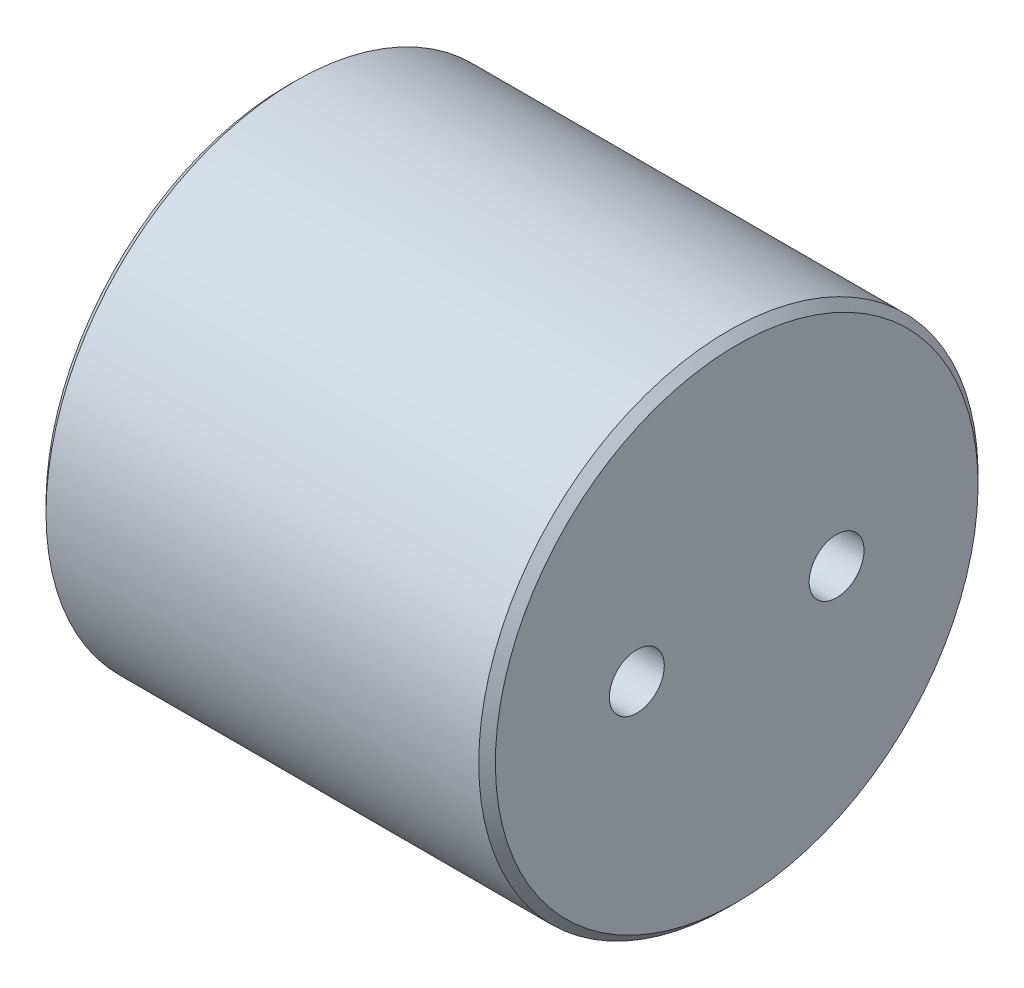
ISO-10303-21;
HEADER;
FILE_DESCRIPTION(('STEP AP214'),'2;1');
FILE_NAME('part.step','',(''),(''),'','','');
FILE_SCHEMA(('AUTOMOTIVE_DESIGN { 1 0 10303 214 1 1 1 1 }'));
ENDSEC;
DATA;
#1=APPLICATION_CONTEXT('core data for automotive mechanical design processes');
#2=APPLICATION_PROTOCOL_DEFINITION('international standard','automotive_design',2000,#1);
#3=PRODUCT_CONTEXT('',#1,'mechanical');
#4=PRODUCT('Part','Part','',(#3));
#5=PRODUCT_RELATED_PRODUCT_CATEGORY('part','',(#4));
#6=PRODUCT_DEFINITION_FORMATION('','',#4);
#7=PRODUCT_DEFINITION_CONTEXT('part definition',#1,'design');
#8=PRODUCT_DEFINITION('design','',#6,#7);
#9=PRODUCT_DEFINITION_SHAPE('','',#8);
#10=(LENGTH_UNIT() NAMED_UNIT(*) SI_UNIT(.MILLI.,.METRE.));
#11=(NAMED_UNIT(*) PLANE_ANGLE_UNIT() SI_UNIT($,.RADIAN.));
#12=(NAMED_UNIT(*) SI_UNIT($,.STERADIAN.) SOLID_ANGLE_UNIT());
#13=UNCERTAINTY_MEASURE_WITH_UNIT(LENGTH_MEASURE(1.E-05),#10,'distance_accuracy_value','');
#14=(GEOMETRIC_REPRESENTATION_CONTEXT(3) GLOBAL_UNCERTAINTY_ASSIGNED_CONTEXT((#13)) GLOBAL_UNIT_ASSIGNED_CONTEXT((#10,
#11,#12)) REPRESENTATION_CONTEXT('',''));
#15=CARTESIAN_POINT('',(0.,0.,0.));
#16=DIRECTION('',(0.,0.,1.));
#17=DIRECTION('',(1.,0.,0.));
#18=AXIS2_PLACEMENT_3D('',#15,#16,#17);
#19=CARTESIAN_POINT('',(-1.99999999995271,0.,6.));
#20=DIRECTION('',(-1.,0.,0.));
#21=DIRECTION('',(0.,0.,1.));
#22=AXIS2_PLACEMENT_3D('',#19,#20,#21);
#23=CONICAL_SURFACE('',#22,1.64999999989868,1.02974425856973);
#24=CARTESIAN_POINT('',(-2.,0.,6.));
#25=DIRECTION('',(-1.,0.,0.));
#26=DIRECTION('',(0.,0.,1.));
#27=AXIS2_PLACEMENT_3D('',#24,#25,#26);
#28=CIRCLE('',#27,1.65);
#29=CARTESIAN_POINT('',(-2.,0.,7.65));
#30=VERTEX_POINT('',#29);
#31=EDGE_CURVE('E108',#30,#30,#28,.T.);
#32=ORIENTED_EDGE('',*,*,#31,.T.);
#33=EDGE_LOOP('',(#32));
#34=FACE_BOUND('',#33,.T.);
#35=CARTESIAN_POINT('',(-1.00857997858839,0.,5.99999999988654));
#36=VERTEX_POINT('',#35);
#37=VERTEX_LOOP('',#36);
#38=FACE_BOUND('',#37,.T.);
#39=ADVANCED_FACE('F16',(#34,#38),#23,.F.);
#40=CARTESIAN_POINT('',(-1.99999999995271,0.,-6.));
#41=DIRECTION('',(-1.,0.,0.));
#42=DIRECTION('',(0.,0.,1.));
#43=AXIS2_PLACEMENT_3D('',#40,#41,#42);
#44=CONICAL_SURFACE('',#43,1.64999999984138,1.02974425856948);
#45=CARTESIAN_POINT('',(-2.,0.,-6.));
#46=DIRECTION('',(-1.,0.,0.));
#47=DIRECTION('',(0.,0.,1.));
#48=AXIS2_PLACEMENT_3D('',#45,#46,#47);
#49=CIRCLE('',#48,1.65);
#50=CARTESIAN_POINT('',(-2.,0.,-4.35));
#51=VERTEX_POINT('',#50);
#52=EDGE_CURVE('E103',#51,#51,#49,.T.);
#53=ORIENTED_EDGE('',*,*,#52,.T.);
#54=EDGE_LOOP('',(#53));
#55=FACE_BOUND('',#54,.T.);
#56=CARTESIAN_POINT('',(-1.00857997858839,0.,-6.00000000019918));
#57=VERTEX_POINT('',#56);
#58=VERTEX_LOOP('',#57);
#59=FACE_BOUND('',#58,.T.);
#60=ADVANCED_FACE('F39',(#55,#59),#44,.F.);
#61=CARTESIAN_POINT('',(1.99999999995271,0.,6.));
#62=DIRECTION('',(1.,0.,0.));
#63=DIRECTION('',(0.,0.,-1.));
#64=AXIS2_PLACEMENT_3D('',#61,#62,#63);
#65=CONICAL_SURFACE('',#64,1.64999999984138,1.02974425856948);
#66=CARTESIAN_POINT('',(2.,0.,6.));
#67=DIRECTION('',(1.,0.,0.));
#68=DIRECTION('',(0.,0.,-1.));
#69=AXIS2_PLACEMENT_3D('',#66,#67,#68);
#70=CIRCLE('',#69,1.65);
#71=CARTESIAN_POINT('',(2.,0.,4.35));
#72=VERTEX_POINT('',#71);
#73=EDGE_CURVE('E100',#72,#72,#70,.T.);
#74=ORIENTED_EDGE('',*,*,#73,.T.);
#75=EDGE_LOOP('',(#74));
#76=FACE_BOUND('',#75,.T.);
#77=CARTESIAN_POINT('',(1.00857997858839,0.,6.00000000019918));
#78=VERTEX_POINT('',#77);
#79=VERTEX_LOOP('',#78);
#80=FACE_BOUND('',#79,.T.);
#81=ADVANCED_FACE('F45',(#76,#80),#65,.F.);
#82=CARTESIAN_POINT('',(1.99999999995271,0.,-6.));
#83=DIRECTION('',(1.,0.,0.));
#84=DIRECTION('',(0.,0.,-1.));
#85=AXIS2_PLACEMENT_3D('',#82,#83,#84);
#86=CONICAL_SURFACE('',#85,1.64999999989868,1.02974425856973);
#87=CARTESIAN_POINT('',(2.,0.,-6.));
#88=DIRECTION('',(1.,0.,0.));
#89=DIRECTION('',(0.,0.,-1.));
#90=AXIS2_PLACEMENT_3D('',#87,#88,#89);
#91=CIRCLE('',#90,1.65);
#92=CARTESIAN_POINT('',(2.,0.,-7.65));
#93=VERTEX_POINT('',#92);
#94=EDGE_CURVE('E102',#93,#93,#91,.T.);
#95=ORIENTED_EDGE('',*,*,#94,.T.);
#96=EDGE_LOOP('',(#95));
#97=FACE_BOUND('',#96,.T.);
#98=CARTESIAN_POINT('',(1.00857997858839,0.,-5.99999999988654));
#99=VERTEX_POINT('',#98);
#100=VERTEX_LOOP('',#99);
#101=FACE_BOUND('',#100,.T.);
#102=ADVANCED_FACE('F88',(#97,#101),#86,.F.);
#103=CARTESIAN_POINT('',(-13.5,0.,6.));
#104=DIRECTION('',(-1.,0.,0.));
#105=DIRECTION('',(0.,0.,1.));
#106=AXIS2_PLACEMENT_3D('',#103,#104,#105);
#107=CYLINDRICAL_SURFACE('',#106,1.65);
#108=CARTESIAN_POINT('',(-13.5,0.,6.));
#109=DIRECTION('',(-1.,0.,0.));
#110=DIRECTION('',(0.,0.,1.));
#111=AXIS2_PLACEMENT_3D('',#108,#109,#110);
#112=CIRCLE('',#111,1.65);
#113=CARTESIAN_POINT('',(-13.5,0.,7.65));
#114=VERTEX_POINT('',#113);
#115=EDGE_CURVE('E19',#114,#114,#112,.F.);
#116=ORIENTED_EDGE('',*,*,#115,.F.);
#117=EDGE_LOOP('',(#116));
#118=FACE_BOUND('',#117,.T.);
#119=ORIENTED_EDGE('',*,*,#31,.F.);
#120=EDGE_LOOP('',(#119));
#121=FACE_BOUND('',#120,.T.);
#122=ADVANCED_FACE('F84',(#118,#121),#107,.F.);
#123=CARTESIAN_POINT('',(-13.5,0.,-6.));
#124=DIRECTION('',(-1.,0.,0.));
#125=DIRECTION('',(0.,0.,1.));
#126=AXIS2_PLACEMENT_3D('',#123,#124,#125);
#127=CYLINDRICAL_SURFACE('',#126,1.65);
#128=CARTESIAN_POINT('',(-13.5,0.,-6.));
#129=DIRECTION('',(-1.,0.,0.));
#130=DIRECTION('',(0.,0.,1.));
#131=AXIS2_PLACEMENT_3D('',#128,#129,#130);
#132=CIRCLE('',#131,1.65);
#133=CARTESIAN_POINT('',(-13.5,0.,-4.35));
#134=VERTEX_POINT('',#133);
#135=EDGE_CURVE('E123',#134,#134,#132,.F.);
#136=ORIENTED_EDGE('',*,*,#135,.F.);
#137=EDGE_LOOP('',(#136));
#138=FACE_BOUND('',#137,.T.);
#139=ORIENTED_EDGE('',*,*,#52,.F.);
#140=EDGE_LOOP('',(#139));
#141=FACE_BOUND('',#140,.T.);
#142=ADVANCED_FACE('F80',(#138,#141),#127,.F.);
#143=CARTESIAN_POINT('',(13.5,0.,6.));
#144=DIRECTION('',(1.,0.,0.));
#145=DIRECTION('',(0.,0.,-1.));
#146=AXIS2_PLACEMENT_3D('',#143,#144,#145);
#147=CYLINDRICAL_SURFACE('',#146,1.65);
#148=CARTESIAN_POINT('',(13.5,0.,6.));
#149=DIRECTION('',(1.,0.,0.));
#150=DIRECTION('',(0.,0.,-1.));
#151=AXIS2_PLACEMENT_3D('',#148,#149,#150);
#152=CIRCLE('',#151,1.65);
#153=CARTESIAN_POINT('',(13.5,0.,4.35));
#154=VERTEX_POINT('',#153);
#155=EDGE_CURVE('E121',#154,#154,#152,.F.);
#156=ORIENTED_EDGE('',*,*,#155,.F.);
#157=EDGE_LOOP('',(#156));
#158=FACE_BOUND('',#157,.T.);
#159=ORIENTED_EDGE('',*,*,#73,.F.);
#160=EDGE_LOOP('',(#159));
#161=FACE_BOUND('',#160,.T.);
#162=ADVANCED_FACE('F76',(#158,#161),#147,.F.);
#163=CARTESIAN_POINT('',(13.5,0.,-6.));
#164=DIRECTION('',(1.,0.,0.));
#165=DIRECTION('',(0.,0.,-1.));
#166=AXIS2_PLACEMENT_3D('',#163,#164,#165);
#167=CYLINDRICAL_SURFACE('',#166,1.65);
#168=CARTESIAN_POINT('',(13.5,0.,-6.));
#169=DIRECTION('',(1.,0.,0.));
#170=DIRECTION('',(0.,0.,-1.));
#171=AXIS2_PLACEMENT_3D('',#168,#169,#170);
#172=CIRCLE('',#171,1.65);
#173=CARTESIAN_POINT('',(13.5,0.,-7.65));
#174=VERTEX_POINT('',#173);
#175=EDGE_CURVE('E118',#174,#174,#172,.F.);
#176=ORIENTED_EDGE('',*,*,#175,.F.);
#177=EDGE_LOOP('',(#176));
#178=FACE_BOUND('',#177,.T.);
#179=ORIENTED_EDGE('',*,*,#94,.F.);
#180=EDGE_LOOP('',(#179));
#181=FACE_BOUND('',#180,.T.);
#182=ADVANCED_FACE('F72',(#178,#181),#167,.F.);
#183=CARTESIAN_POINT('',(-13.5,-15.,0.));
#184=DIRECTION('',(-1.,0.,0.));
#185=DIRECTION('',(0.,0.,1.));
#186=AXIS2_PLACEMENT_3D('',#183,#184,#185);
#187=PLANE('',#186);
#188=ORIENTED_EDGE('',*,*,#135,.T.);
#189=EDGE_LOOP('',(#188));
#190=FACE_BOUND('',#189,.T.);
#191=ORIENTED_EDGE('',*,*,#115,.T.);
#192=EDGE_LOOP('',(#191));
#193=FACE_BOUND('',#192,.T.);
#194=CARTESIAN_POINT('',(-13.5,0.,0.));
#195=DIRECTION('',(1.,0.,0.));
#196=DIRECTION('',(0.,1.,0.));
#197=AXIS2_PLACEMENT_3D('',#194,#195,#196);
#198=CIRCLE('',#197,14.5);
#199=CARTESIAN_POINT('',(-13.5,14.5,0.));
#200=VERTEX_POINT('',#199);
#201=EDGE_CURVE('E115',#200,#200,#198,.T.);
#202=ORIENTED_EDGE('',*,*,#201,.F.);
#203=EDGE_LOOP('',(#202));
#204=FACE_BOUND('',#203,.T.);
#205=ADVANCED_FACE('F68',(#190,#193,#204),#187,.T.);
#206=CARTESIAN_POINT('',(13.5,-15.,0.));
#207=DIRECTION('',(1.,0.,0.));
#208=DIRECTION('',(0.,0.,-1.));
#209=AXIS2_PLACEMENT_3D('',#206,#207,#208);
#210=PLANE('',#209);
#211=ORIENTED_EDGE('',*,*,#175,.T.);
#212=EDGE_LOOP('',(#211));
#213=FACE_BOUND('',#212,.T.);
#214=ORIENTED_EDGE('',*,*,#155,.T.);
#215=EDGE_LOOP('',(#214));
#216=FACE_BOUND('',#215,.T.);
#217=CARTESIAN_POINT('',(13.5,0.,0.));
#218=DIRECTION('',(-1.,0.,0.));
#219=DIRECTION('',(0.,-1.,0.));
#220=AXIS2_PLACEMENT_3D('',#217,#218,#219);
#221=CIRCLE('',#220,14.5);
#222=CARTESIAN_POINT('',(13.5,-14.5,0.));
#223=VERTEX_POINT('',#222);
#224=EDGE_CURVE('E112',#223,#223,#221,.T.);
#225=ORIENTED_EDGE('',*,*,#224,.F.);
#226=EDGE_LOOP('',(#225));
#227=FACE_BOUND('',#226,.T.);
#228=ADVANCED_FACE('F64',(#213,#216,#227),#210,.T.);
#229=CARTESIAN_POINT('',(-13.,0.,0.));
#230=DIRECTION('',(1.,0.,0.));
#231=DIRECTION('',(0.,1.,0.));
#232=AXIS2_PLACEMENT_3D('',#229,#230,#231);
#233=CONICAL_SURFACE('',#232,15.,0.785398163397299);
#234=CARTESIAN_POINT('',(-13.,0.,0.));
#235=DIRECTION('',(-1.,0.,0.));
#236=DIRECTION('',(0.,0.,1.));
#237=AXIS2_PLACEMENT_3D('',#234,#235,#236);
#238=CIRCLE('',#237,15.);
#239=CARTESIAN_POINT('',(-13.,0.,15.));
#240=VERTEX_POINT('',#239);
#241=EDGE_CURVE('E25',#240,#240,#238,.F.);
#242=ORIENTED_EDGE('',*,*,#241,.F.);
#243=EDGE_LOOP('',(#242));
#244=FACE_BOUND('',#243,.T.);
#245=ORIENTED_EDGE('',*,*,#201,.T.);
#246=EDGE_LOOP('',(#245));
#247=FACE_BOUND('',#246,.T.);
#248=ADVANCED_FACE('F56',(#244,#247),#233,.T.);
#249=CARTESIAN_POINT('',(13.,0.,0.));
#250=DIRECTION('',(-1.,0.,0.));
#251=DIRECTION('',(0.,-1.,0.));
#252=AXIS2_PLACEMENT_3D('',#249,#250,#251);
#253=CONICAL_SURFACE('',#252,15.,0.785398163397299);
#254=CARTESIAN_POINT('',(13.,0.,0.));
#255=DIRECTION('',(-1.,0.,0.));
#256=DIRECTION('',(0.,0.,1.));
#257=AXIS2_PLACEMENT_3D('',#254,#255,#256);
#258=CIRCLE('',#257,15.);
#259=CARTESIAN_POINT('',(13.,0.,15.));
#260=VERTEX_POINT('',#259);
#261=EDGE_CURVE('E11',#260,#260,#258,.T.);
#262=ORIENTED_EDGE('',*,*,#261,.F.);
#263=EDGE_LOOP('',(#262));
#264=FACE_BOUND('',#263,.T.);
#265=ORIENTED_EDGE('',*,*,#224,.T.);
#266=EDGE_LOOP('',(#265));
#267=FACE_BOUND('',#266,.T.);
#268=ADVANCED_FACE('F50',(#264,#267),#253,.T.);
#269=CARTESIAN_POINT('',(0.,0.,0.));
#270=DIRECTION('',(-1.,0.,0.));
#271=DIRECTION('',(0.,0.,1.));
#272=AXIS2_PLACEMENT_3D('',#269,#270,#271);
#273=CYLINDRICAL_SURFACE('',#272,15.);
#274=ORIENTED_EDGE('',*,*,#241,.T.);
#275=EDGE_LOOP('',(#274));
#276=FACE_BOUND('',#275,.T.);
#277=ORIENTED_EDGE('',*,*,#261,.T.);
#278=EDGE_LOOP('',(#277));
#279=FACE_BOUND('',#278,.T.);
#280=ADVANCED_FACE('F48',(#276,#279),#273,.T.);
#281=CLOSED_SHELL('',(#39,#60,#81,#102,#122,#142,#162,#182,#205,#228,#248,#268,#280));
#282=MANIFOLD_SOLID_BREP('B1',#281);
#283=ADVANCED_BREP_SHAPE_REPRESENTATION('',(#18,#282),#14);
#284=SHAPE_DEFINITION_REPRESENTATION(#9,#283);
ENDSEC;
END-ISO-10303-21;
